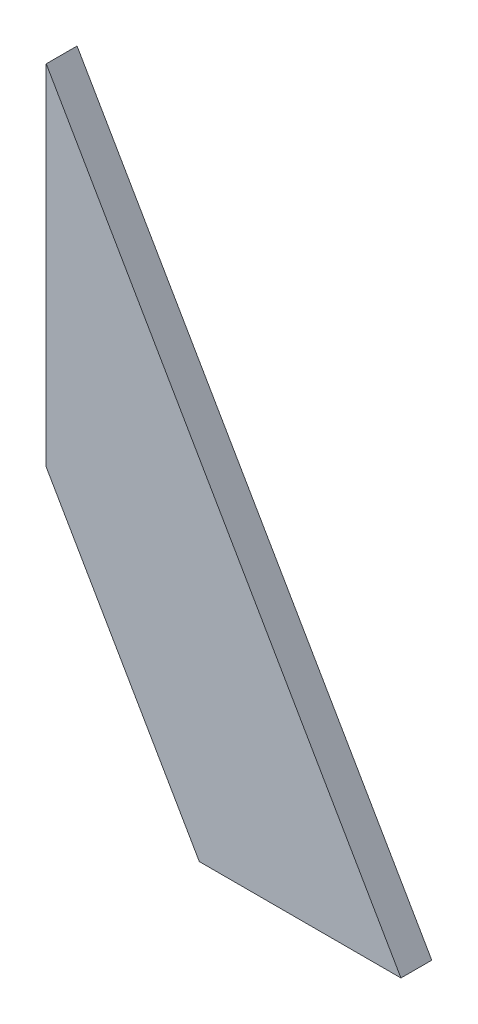
ISO-10303-21;
HEADER;
FILE_DESCRIPTION(('STEP AP214'),'2;1');
FILE_NAME('part.step','',(''),(''),'','','');
FILE_SCHEMA(('AUTOMOTIVE_DESIGN { 1 0 10303 214 1 1 1 1 }'));
ENDSEC;
DATA;
#1=APPLICATION_CONTEXT('core data for automotive mechanical design processes');
#2=APPLICATION_PROTOCOL_DEFINITION('international standard','automotive_design',2000,#1);
#3=PRODUCT_CONTEXT('',#1,'mechanical');
#4=PRODUCT('Part','Part','',(#3));
#5=PRODUCT_RELATED_PRODUCT_CATEGORY('part','',(#4));
#6=PRODUCT_DEFINITION_FORMATION('','',#4);
#7=PRODUCT_DEFINITION_CONTEXT('part definition',#1,'design');
#8=PRODUCT_DEFINITION('design','',#6,#7);
#9=PRODUCT_DEFINITION_SHAPE('','',#8);
#10=(LENGTH_UNIT() NAMED_UNIT(*) SI_UNIT(.MILLI.,.METRE.));
#11=(NAMED_UNIT(*) PLANE_ANGLE_UNIT() SI_UNIT($,.RADIAN.));
#12=(NAMED_UNIT(*) SI_UNIT($,.STERADIAN.) SOLID_ANGLE_UNIT());
#13=UNCERTAINTY_MEASURE_WITH_UNIT(LENGTH_MEASURE(1.E-05),#10,'distance_accuracy_value','');
#14=(GEOMETRIC_REPRESENTATION_CONTEXT(3) GLOBAL_UNCERTAINTY_ASSIGNED_CONTEXT((#13)) GLOBAL_UNIT_ASSIGNED_CONTEXT((#10,
#11,#12)) REPRESENTATION_CONTEXT('',''));
#15=CARTESIAN_POINT('',(0.,0.,0.));
#16=DIRECTION('',(0.,0.,1.));
#17=DIRECTION('',(1.,0.,0.));
#18=AXIS2_PLACEMENT_3D('',#15,#16,#17);
#19=CARTESIAN_POINT('',(-781.658049828356,200.591156570926,3.));
#20=DIRECTION('',(-0.866025403784436,-0.500000000000005,0.));
#21=DIRECTION('',(0.500000000000005,-0.866025403784436,0.));
#22=AXIS2_PLACEMENT_3D('',#19,#20,#21);
#23=PLANE('',#22);
#24=DIRECTION('',(-0.500000000000005,0.866025403784436,0.));
#25=VECTOR('',#24,1.);
#26=CARTESIAN_POINT('',(-781.658049828356,200.591156570926,0.));
#27=LINE('',#26,#25);
#28=CARTESIAN_POINT('',(-781.658049828356,200.591156570926,0.));
#29=VERTEX_POINT('',#28);
#30=CARTESIAN_POINT('',(-816.187231935995,260.397454325153,0.));
#31=VERTEX_POINT('',#30);
#32=EDGE_CURVE('E109',#29,#31,#27,.T.);
#33=ORIENTED_EDGE('',*,*,#32,.T.);
#34=DIRECTION('',(0.,0.,-1.));
#35=VECTOR('',#34,1.);
#36=CARTESIAN_POINT('',(-816.187231935995,260.397454325153,3.));
#37=LINE('',#36,#35);
#38=CARTESIAN_POINT('',(-816.187231935995,260.397454325153,3.));
#39=VERTEX_POINT('',#38);
#40=EDGE_CURVE('E11',#39,#31,#37,.T.);
#41=ORIENTED_EDGE('',*,*,#40,.F.);
#42=DIRECTION('',(-0.500000000000005,0.866025403784436,0.));
#43=VECTOR('',#42,1.);
#44=CARTESIAN_POINT('',(-781.658049828356,200.591156570926,3.));
#45=LINE('',#44,#43);
#46=CARTESIAN_POINT('',(-781.658049828356,200.591156570926,3.));
#47=VERTEX_POINT('',#46);
#48=EDGE_CURVE('E93',#47,#39,#45,.T.);
#49=ORIENTED_EDGE('',*,*,#48,.F.);
#50=DIRECTION('',(0.,0.,-1.));
#51=VECTOR('',#50,1.);
#52=CARTESIAN_POINT('',(-781.658049828356,200.591156570926,3.));
#53=LINE('',#52,#51);
#54=EDGE_CURVE('E105',#47,#29,#53,.T.);
#55=ORIENTED_EDGE('',*,*,#54,.T.);
#56=EDGE_LOOP('',(#33,#41,#49,#55));
#57=FACE_BOUND('',#56,.T.);
#58=ADVANCED_FACE('F41',(#57),#23,.F.);
#59=CARTESIAN_POINT('',(-816.187231935995,260.397454325153,3.));
#60=DIRECTION('',(1.,0.,0.));
#61=DIRECTION('',(0.,0.,-1.));
#62=AXIS2_PLACEMENT_3D('',#59,#60,#61);
#63=PLANE('',#62);
#64=DIRECTION('',(0.,-1.,0.));
#65=VECTOR('',#64,1.);
#66=CARTESIAN_POINT('',(-816.187231935995,260.397454325153,0.));
#67=LINE('',#66,#65);
#68=CARTESIAN_POINT('',(-816.187231935995,226.400083913223,0.));
#69=VERTEX_POINT('',#68);
#70=EDGE_CURVE('E98',#31,#69,#67,.T.);
#71=ORIENTED_EDGE('',*,*,#70,.T.);
#72=DIRECTION('',(0.,0.,-1.));
#73=VECTOR('',#72,1.);
#74=CARTESIAN_POINT('',(-816.187231935995,226.400083913223,3.));
#75=LINE('',#74,#73);
#76=CARTESIAN_POINT('',(-816.187231935995,226.400083913223,3.));
#77=VERTEX_POINT('',#76);
#78=EDGE_CURVE('E50',#77,#69,#75,.T.);
#79=ORIENTED_EDGE('',*,*,#78,.F.);
#80=DIRECTION('',(0.,-1.,0.));
#81=VECTOR('',#80,1.);
#82=CARTESIAN_POINT('',(-816.187231935995,260.397454325153,3.));
#83=LINE('',#82,#81);
#84=EDGE_CURVE('E88',#39,#77,#83,.T.);
#85=ORIENTED_EDGE('',*,*,#84,.F.);
#86=ORIENTED_EDGE('',*,*,#40,.T.);
#87=EDGE_LOOP('',(#71,#79,#85,#86));
#88=FACE_BOUND('',#87,.T.);
#89=ADVANCED_FACE('F97',(#88),#63,.F.);
#90=CARTESIAN_POINT('',(-816.187231935995,226.400083913223,3.));
#91=DIRECTION('',(0.866025403784435,0.500000000000006,0.));
#92=DIRECTION('',(-0.500000000000006,0.866025403784435,0.));
#93=AXIS2_PLACEMENT_3D('',#90,#91,#92);
#94=PLANE('',#93);
#95=DIRECTION('',(0.500000000000006,-0.866025403784435,0.));
#96=VECTOR('',#95,1.);
#97=CARTESIAN_POINT('',(-816.187231935995,226.400083913223,0.));
#98=LINE('',#97,#96);
#99=CARTESIAN_POINT('',(-801.286440787424,200.591156570926,0.));
#100=VERTEX_POINT('',#99);
#101=EDGE_CURVE('E75',#69,#100,#98,.T.);
#102=ORIENTED_EDGE('',*,*,#101,.T.);
#103=DIRECTION('',(0.,0.,-1.));
#104=VECTOR('',#103,1.);
#105=CARTESIAN_POINT('',(-801.286440787424,200.591156570926,3.));
#106=LINE('',#105,#104);
#107=CARTESIAN_POINT('',(-801.286440787424,200.591156570926,3.));
#108=VERTEX_POINT('',#107);
#109=EDGE_CURVE('E100',#108,#100,#106,.T.);
#110=ORIENTED_EDGE('',*,*,#109,.F.);
#111=DIRECTION('',(0.500000000000006,-0.866025403784435,0.));
#112=VECTOR('',#111,1.);
#113=CARTESIAN_POINT('',(-816.187231935995,226.400083913223,3.));
#114=LINE('',#113,#112);
#115=EDGE_CURVE('E91',#77,#108,#114,.T.);
#116=ORIENTED_EDGE('',*,*,#115,.F.);
#117=ORIENTED_EDGE('',*,*,#78,.T.);
#118=EDGE_LOOP('',(#102,#110,#116,#117));
#119=FACE_BOUND('',#118,.T.);
#120=ADVANCED_FACE('F101',(#119),#94,.F.);
#121=CARTESIAN_POINT('',(-801.286440787424,200.591156570926,3.));
#122=DIRECTION('',(0.,1.,0.));
#123=DIRECTION('',(-1.,0.,0.));
#124=AXIS2_PLACEMENT_3D('',#121,#122,#123);
#125=PLANE('',#124);
#126=DIRECTION('',(1.,0.,0.));
#127=VECTOR('',#126,1.);
#128=CARTESIAN_POINT('',(-801.286440787424,200.591156570926,0.));
#129=LINE('',#128,#127);
#130=EDGE_CURVE('E81',#100,#29,#129,.T.);
#131=ORIENTED_EDGE('',*,*,#130,.T.);
#132=ORIENTED_EDGE('',*,*,#54,.F.);
#133=DIRECTION('',(1.,0.,0.));
#134=VECTOR('',#133,1.);
#135=CARTESIAN_POINT('',(-801.286440787424,200.591156570926,3.));
#136=LINE('',#135,#134);
#137=EDGE_CURVE('E58',#108,#47,#136,.T.);
#138=ORIENTED_EDGE('',*,*,#137,.F.);
#139=ORIENTED_EDGE('',*,*,#109,.T.);
#140=EDGE_LOOP('',(#131,#132,#138,#139));
#141=FACE_BOUND('',#140,.T.);
#142=ADVANCED_FACE('F122',(#141),#125,.F.);
#143=CARTESIAN_POINT('',(0.,0.,3.));
#144=DIRECTION('',(0.,0.,-1.));
#145=DIRECTION('',(-1.,0.,0.));
#146=AXIS2_PLACEMENT_3D('',#143,#144,#145);
#147=PLANE('',#146);
#148=ORIENTED_EDGE('',*,*,#48,.T.);
#149=ORIENTED_EDGE('',*,*,#84,.T.);
#150=ORIENTED_EDGE('',*,*,#115,.T.);
#151=ORIENTED_EDGE('',*,*,#137,.T.);
#152=EDGE_LOOP('',(#148,#149,#150,#151));
#153=FACE_BOUND('',#152,.T.);
#154=ADVANCED_FACE('F89',(#153),#147,.F.);
#155=CARTESIAN_POINT('',(0.,0.,0.));
#156=DIRECTION('',(0.,0.,-1.));
#157=DIRECTION('',(-1.,0.,0.));
#158=AXIS2_PLACEMENT_3D('',#155,#156,#157);
#159=PLANE('',#158);
#160=ORIENTED_EDGE('',*,*,#32,.F.);
#161=ORIENTED_EDGE('',*,*,#130,.F.);
#162=ORIENTED_EDGE('',*,*,#101,.F.);
#163=ORIENTED_EDGE('',*,*,#70,.F.);
#164=EDGE_LOOP('',(#160,#161,#162,#163));
#165=FACE_BOUND('',#164,.T.);
#166=ADVANCED_FACE('F125',(#165),#159,.T.);
#167=CLOSED_SHELL('',(#58,#89,#120,#142,#154,#166));
#168=MANIFOLD_SOLID_BREP('B2',#167);
#169=ADVANCED_BREP_SHAPE_REPRESENTATION('',(#18,#168),#14);
#170=SHAPE_DEFINITION_REPRESENTATION(#9,#169);
ENDSEC;
END-ISO-10303-21;
